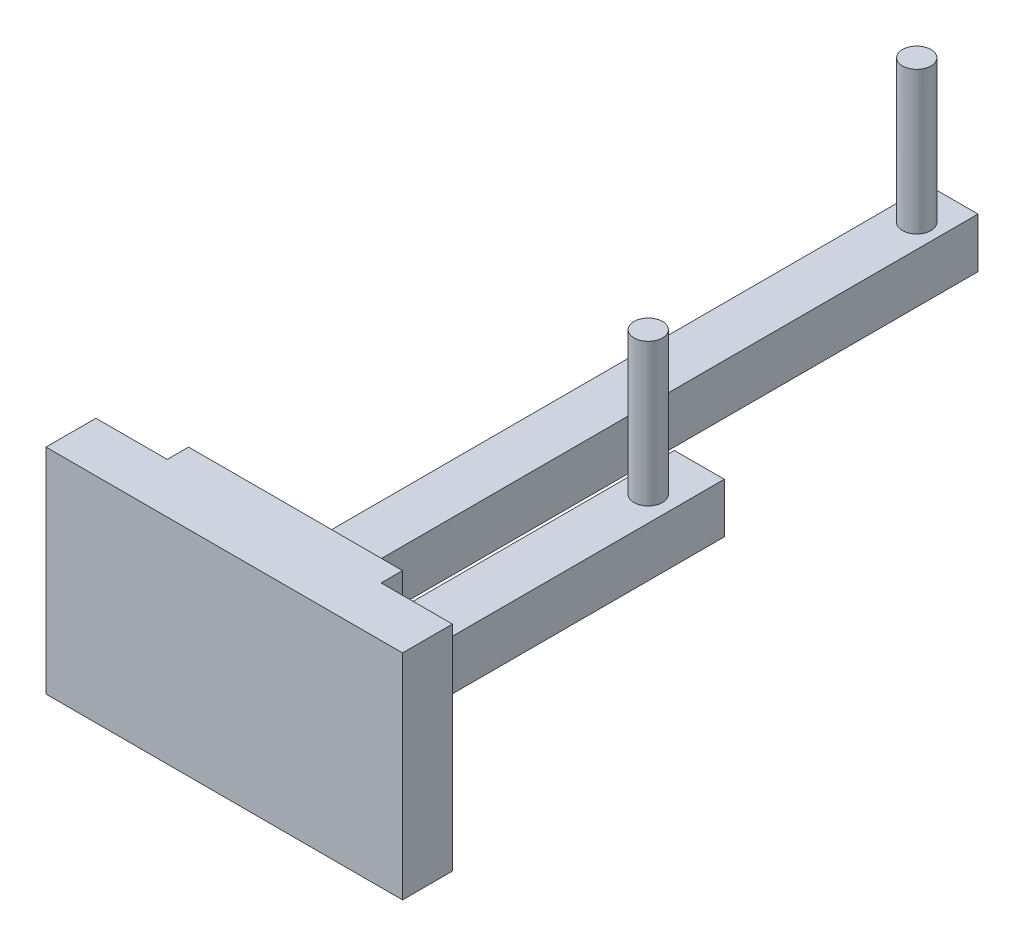
ISO-10303-21;
HEADER;
FILE_DESCRIPTION(('STEP AP214'),'2;1');
FILE_NAME('part.step','',(''),(''),'','','');
FILE_SCHEMA(('AUTOMOTIVE_DESIGN { 1 0 10303 214 1 1 1 1 }'));
ENDSEC;
DATA;
#1=APPLICATION_CONTEXT('core data for automotive mechanical design processes');
#2=APPLICATION_PROTOCOL_DEFINITION('international standard','automotive_design',2000,#1);
#3=PRODUCT_CONTEXT('',#1,'mechanical');
#4=PRODUCT('Part','Part','',(#3));
#5=PRODUCT_RELATED_PRODUCT_CATEGORY('part','',(#4));
#6=PRODUCT_DEFINITION_FORMATION('','',#4);
#7=PRODUCT_DEFINITION_CONTEXT('part definition',#1,'design');
#8=PRODUCT_DEFINITION('design','',#6,#7);
#9=PRODUCT_DEFINITION_SHAPE('','',#8);
#10=(LENGTH_UNIT() NAMED_UNIT(*) SI_UNIT(.MILLI.,.METRE.));
#11=(NAMED_UNIT(*) PLANE_ANGLE_UNIT() SI_UNIT($,.RADIAN.));
#12=(NAMED_UNIT(*) SI_UNIT($,.STERADIAN.) SOLID_ANGLE_UNIT());
#13=UNCERTAINTY_MEASURE_WITH_UNIT(LENGTH_MEASURE(1.E-05),#10,'distance_accuracy_value','');
#14=(GEOMETRIC_REPRESENTATION_CONTEXT(3) GLOBAL_UNCERTAINTY_ASSIGNED_CONTEXT((#13)) GLOBAL_UNIT_ASSIGNED_CONTEXT((#10,
#11,#12)) REPRESENTATION_CONTEXT('',''));
#15=CARTESIAN_POINT('',(0.,0.,0.));
#16=DIRECTION('',(0.,0.,1.));
#17=DIRECTION('',(1.,0.,0.));
#18=AXIS2_PLACEMENT_3D('',#15,#16,#17);
#19=CARTESIAN_POINT('',(0.,0.,-3.));
#20=DIRECTION('',(0.,0.,-1.));
#21=DIRECTION('',(-1.,0.,0.));
#22=AXIS2_PLACEMENT_3D('',#19,#20,#21);
#23=PLANE('',#22);
#24=DIRECTION('',(0.,-1.,0.));
#25=VECTOR('',#24,1.);
#26=CARTESIAN_POINT('',(15.,-15.,-3.));
#27=LINE('',#26,#25);
#28=CARTESIAN_POINT('',(15.,15.,-3.));
#29=VERTEX_POINT('',#28);
#30=CARTESIAN_POINT('',(15.,-15.,-3.));
#31=VERTEX_POINT('',#30);
#32=EDGE_CURVE('E231',#29,#31,#27,.T.);
#33=ORIENTED_EDGE('',*,*,#32,.T.);
#34=DIRECTION('',(-1.,0.,0.));
#35=VECTOR('',#34,1.);
#36=CARTESIAN_POINT('',(-15.,-15.,-3.));
#37=LINE('',#36,#35);
#38=CARTESIAN_POINT('',(-15.,-15.,-3.));
#39=VERTEX_POINT('',#38);
#40=EDGE_CURVE('E235',#31,#39,#37,.T.);
#41=ORIENTED_EDGE('',*,*,#40,.T.);
#42=DIRECTION('',(0.,1.,0.));
#43=VECTOR('',#42,1.);
#44=CARTESIAN_POINT('',(-15.,-15.,-3.));
#45=LINE('',#44,#43);
#46=CARTESIAN_POINT('',(-15.,15.,-3.));
#47=VERTEX_POINT('',#46);
#48=EDGE_CURVE('E239',#39,#47,#45,.T.);
#49=ORIENTED_EDGE('',*,*,#48,.T.);
#50=DIRECTION('',(1.,0.,0.));
#51=VECTOR('',#50,1.);
#52=CARTESIAN_POINT('',(-15.,15.,-3.));
#53=LINE('',#52,#51);
#54=EDGE_CURVE('E242',#47,#29,#53,.T.);
#55=ORIENTED_EDGE('',*,*,#54,.T.);
#56=EDGE_LOOP('',(#33,#41,#49,#55));
#57=FACE_BOUND('',#56,.T.);
#58=DIRECTION('',(-1.,0.,0.));
#59=VECTOR('',#58,1.);
#60=CARTESIAN_POINT('',(3.12091937544568,-8.34885414843089,-3.));
#61=LINE('',#60,#59);
#62=CARTESIAN_POINT('',(10.1209193754457,-8.3488541484309,-3.));
#63=VERTEX_POINT('',#62);
#64=CARTESIAN_POINT('',(3.12091937544568,-8.34885414843089,-3.));
#65=VERTEX_POINT('',#64);
#66=EDGE_CURVE('E210',#63,#65,#61,.T.);
#67=ORIENTED_EDGE('',*,*,#66,.F.);
#68=DIRECTION('',(0.,-1.,0.));
#69=VECTOR('',#68,1.);
#70=CARTESIAN_POINT('',(10.1209193754457,-8.3488541484309,-3.));
#71=LINE('',#70,#69);
#72=CARTESIAN_POINT('',(10.1209193754457,-1.3488541484309,-3.));
#73=VERTEX_POINT('',#72);
#74=EDGE_CURVE('E187',#73,#63,#71,.T.);
#75=ORIENTED_EDGE('',*,*,#74,.F.);
#76=DIRECTION('',(1.,0.,0.));
#77=VECTOR('',#76,1.);
#78=CARTESIAN_POINT('',(3.12091937544568,-1.34885414843089,-3.));
#79=LINE('',#78,#77);
#80=CARTESIAN_POINT('',(3.12091937544568,-1.34885414843089,-3.));
#81=VERTEX_POINT('',#80);
#82=EDGE_CURVE('E197',#81,#73,#79,.T.);
#83=ORIENTED_EDGE('',*,*,#82,.F.);
#84=DIRECTION('',(0.,1.,0.));
#85=VECTOR('',#84,1.);
#86=CARTESIAN_POINT('',(3.12091937544568,-8.34885414843089,-3.));
#87=LINE('',#86,#85);
#88=EDGE_CURVE('E213',#65,#81,#87,.T.);
#89=ORIENTED_EDGE('',*,*,#88,.F.);
#90=EDGE_LOOP('',(#67,#75,#83,#89));
#91=FACE_BOUND('',#90,.T.);
#92=DIRECTION('',(1.,0.,0.));
#93=VECTOR('',#92,1.);
#94=CARTESIAN_POINT('',(-4.29629000325599,-1.34885414843089,-3.));
#95=LINE('',#94,#93);
#96=CARTESIAN_POINT('',(-11.296290003256,-1.34885414843089,-3.));
#97=VERTEX_POINT('',#96);
#98=CARTESIAN_POINT('',(-4.29629000325599,-1.34885414843089,-3.));
#99=VERTEX_POINT('',#98);
#100=EDGE_CURVE('E562',#97,#99,#95,.T.);
#101=ORIENTED_EDGE('',*,*,#100,.F.);
#102=DIRECTION('',(0.,1.,0.));
#103=VECTOR('',#102,1.);
#104=CARTESIAN_POINT('',(-11.296290003256,-8.34885414843089,-3.));
#105=LINE('',#104,#103);
#106=CARTESIAN_POINT('',(-11.296290003256,-8.34885414843089,-3.));
#107=VERTEX_POINT('',#106);
#108=EDGE_CURVE('E179',#107,#97,#105,.T.);
#109=ORIENTED_EDGE('',*,*,#108,.F.);
#110=DIRECTION('',(-1.,0.,0.));
#111=VECTOR('',#110,1.);
#112=CARTESIAN_POINT('',(-4.29629000325599,-8.34885414843089,-3.));
#113=LINE('',#112,#111);
#114=CARTESIAN_POINT('',(-4.29629000325599,-8.34885414843089,-3.));
#115=VERTEX_POINT('',#114);
#116=EDGE_CURVE('E175',#115,#107,#113,.T.);
#117=ORIENTED_EDGE('',*,*,#116,.F.);
#118=DIRECTION('',(0.,-1.,0.));
#119=VECTOR('',#118,1.);
#120=CARTESIAN_POINT('',(-4.29629000325599,-8.34885414843089,-3.));
#121=LINE('',#120,#119);
#122=EDGE_CURVE('E572',#99,#115,#121,.T.);
#123=ORIENTED_EDGE('',*,*,#122,.F.);
#124=EDGE_LOOP('',(#101,#109,#117,#123));
#125=FACE_BOUND('',#124,.T.);
#126=ADVANCED_FACE('F39',(#57,#91,#125),#23,.T.);
#127=CARTESIAN_POINT('',(0.,0.,0.));
#128=DIRECTION('',(0.,0.,1.));
#129=DIRECTION('',(1.,0.,0.));
#130=AXIS2_PLACEMENT_3D('',#127,#128,#129);
#131=PLANE('',#130);
#132=DIRECTION('',(0.,-1.,0.));
#133=VECTOR('',#132,1.);
#134=CARTESIAN_POINT('',(15.,-15.,0.));
#135=LINE('',#134,#133);
#136=CARTESIAN_POINT('',(15.,15.,0.));
#137=VERTEX_POINT('',#136);
#138=CARTESIAN_POINT('',(15.,-15.,0.));
#139=VERTEX_POINT('',#138);
#140=EDGE_CURVE('E230',#137,#139,#135,.T.);
#141=ORIENTED_EDGE('',*,*,#140,.F.);
#142=DIRECTION('',(1.,0.,0.));
#143=VECTOR('',#142,1.);
#144=CARTESIAN_POINT('',(0.,15.,0.));
#145=LINE('',#144,#143);
#146=CARTESIAN_POINT('',(25.,15.,0.));
#147=VERTEX_POINT('',#146);
#148=EDGE_CURVE('E267',#137,#147,#145,.T.);
#149=ORIENTED_EDGE('',*,*,#148,.T.);
#150=DIRECTION('',(0.,1.,0.));
#151=VECTOR('',#150,1.);
#152=CARTESIAN_POINT('',(25.,0.,0.));
#153=LINE('',#152,#151);
#154=CARTESIAN_POINT('',(25.,-15.,0.));
#155=VERTEX_POINT('',#154);
#156=EDGE_CURVE('E273',#155,#147,#153,.T.);
#157=ORIENTED_EDGE('',*,*,#156,.F.);
#158=DIRECTION('',(1.,0.,0.));
#159=VECTOR('',#158,1.);
#160=CARTESIAN_POINT('',(0.,-15.,0.));
#161=LINE('',#160,#159);
#162=EDGE_CURVE('E291',#139,#155,#161,.T.);
#163=ORIENTED_EDGE('',*,*,#162,.F.);
#164=EDGE_LOOP('',(#141,#149,#157,#163));
#165=FACE_BOUND('',#164,.T.);
#166=ADVANCED_FACE('F348',(#165),#131,.F.);
#167=DIRECTION('',(0.,1.,0.));
#168=VECTOR('',#167,1.);
#169=CARTESIAN_POINT('',(-15.,-15.,0.));
#170=LINE('',#169,#168);
#171=CARTESIAN_POINT('',(-15.,-15.,0.));
#172=VERTEX_POINT('',#171);
#173=CARTESIAN_POINT('',(-15.,15.,0.));
#174=VERTEX_POINT('',#173);
#175=EDGE_CURVE('E236',#172,#174,#170,.T.);
#176=ORIENTED_EDGE('',*,*,#175,.F.);
#177=CARTESIAN_POINT('',(-25.,-15.,0.));
#178=VERTEX_POINT('',#177);
#179=EDGE_CURVE('E292',#178,#172,#161,.T.);
#180=ORIENTED_EDGE('',*,*,#179,.F.);
#181=DIRECTION('',(0.,1.,0.));
#182=VECTOR('',#181,1.);
#183=CARTESIAN_POINT('',(-25.,0.,0.));
#184=LINE('',#183,#182);
#185=CARTESIAN_POINT('',(-25.,15.,0.));
#186=VERTEX_POINT('',#185);
#187=EDGE_CURVE('E287',#178,#186,#184,.T.);
#188=ORIENTED_EDGE('',*,*,#187,.T.);
#189=EDGE_CURVE('E284',#186,#174,#145,.T.);
#190=ORIENTED_EDGE('',*,*,#189,.T.);
#191=EDGE_LOOP('',(#176,#180,#188,#190));
#192=FACE_BOUND('',#191,.T.);
#193=ADVANCED_FACE('F354',(#192),#131,.F.);
#194=CARTESIAN_POINT('',(0.,15.,7.));
#195=DIRECTION('',(0.,1.,0.));
#196=DIRECTION('',(0.,0.,1.));
#197=AXIS2_PLACEMENT_3D('',#194,#195,#196);
#198=PLANE('',#197);
#199=ORIENTED_EDGE('',*,*,#189,.F.);
#200=DIRECTION('',(0.,0.,-1.));
#201=VECTOR('',#200,1.);
#202=CARTESIAN_POINT('',(-25.,15.,7.));
#203=LINE('',#202,#201);
#204=CARTESIAN_POINT('',(-25.,15.,7.));
#205=VERTEX_POINT('',#204);
#206=EDGE_CURVE('E309',#205,#186,#203,.T.);
#207=ORIENTED_EDGE('',*,*,#206,.F.);
#208=DIRECTION('',(1.,0.,0.));
#209=VECTOR('',#208,1.);
#210=CARTESIAN_POINT('',(0.,15.,7.));
#211=LINE('',#210,#209);
#212=CARTESIAN_POINT('',(25.,15.,7.));
#213=VERTEX_POINT('',#212);
#214=EDGE_CURVE('E268',#205,#213,#211,.T.);
#215=ORIENTED_EDGE('',*,*,#214,.T.);
#216=DIRECTION('',(0.,0.,-1.));
#217=VECTOR('',#216,1.);
#218=CARTESIAN_POINT('',(25.,15.,7.));
#219=LINE('',#218,#217);
#220=EDGE_CURVE('E283',#213,#147,#219,.T.);
#221=ORIENTED_EDGE('',*,*,#220,.T.);
#222=ORIENTED_EDGE('',*,*,#148,.F.);
#223=DIRECTION('',(0.,0.,1.));
#224=VECTOR('',#223,1.);
#225=CARTESIAN_POINT('',(15.,15.,-3.));
#226=LINE('',#225,#224);
#227=EDGE_CURVE('E245',#29,#137,#226,.T.);
#228=ORIENTED_EDGE('',*,*,#227,.F.);
#229=ORIENTED_EDGE('',*,*,#54,.F.);
#230=DIRECTION('',(0.,0.,1.));
#231=VECTOR('',#230,1.);
#232=CARTESIAN_POINT('',(-15.,15.,-3.));
#233=LINE('',#232,#231);
#234=EDGE_CURVE('E255',#47,#174,#233,.T.);
#235=ORIENTED_EDGE('',*,*,#234,.T.);
#236=EDGE_LOOP('',(#199,#207,#215,#221,#222,#228,#229,#235));
#237=FACE_BOUND('',#236,.T.);
#238=ADVANCED_FACE('F41',(#237),#198,.T.);
#239=CARTESIAN_POINT('',(-25.,0.,7.));
#240=DIRECTION('',(-1.,0.,0.));
#241=DIRECTION('',(0.,0.,1.));
#242=AXIS2_PLACEMENT_3D('',#239,#240,#241);
#243=PLANE('',#242);
#244=ORIENTED_EDGE('',*,*,#187,.F.);
#245=DIRECTION('',(0.,0.,-1.));
#246=VECTOR('',#245,1.);
#247=CARTESIAN_POINT('',(-25.,-15.,7.));
#248=LINE('',#247,#246);
#249=CARTESIAN_POINT('',(-25.,-15.,7.));
#250=VERTEX_POINT('',#249);
#251=EDGE_CURVE('E306',#250,#178,#248,.T.);
#252=ORIENTED_EDGE('',*,*,#251,.F.);
#253=DIRECTION('',(0.,1.,0.));
#254=VECTOR('',#253,1.);
#255=CARTESIAN_POINT('',(-25.,0.,7.));
#256=LINE('',#255,#254);
#257=EDGE_CURVE('E272',#250,#205,#256,.T.);
#258=ORIENTED_EDGE('',*,*,#257,.T.);
#259=ORIENTED_EDGE('',*,*,#206,.T.);
#260=EDGE_LOOP('',(#244,#252,#258,#259));
#261=FACE_BOUND('',#260,.T.);
#262=ADVANCED_FACE('F378',(#261),#243,.T.);
#263=CARTESIAN_POINT('',(0.,-15.,7.));
#264=DIRECTION('',(0.,1.,0.));
#265=DIRECTION('',(0.,0.,1.));
#266=AXIS2_PLACEMENT_3D('',#263,#264,#265);
#267=PLANE('',#266);
#268=ORIENTED_EDGE('',*,*,#179,.T.);
#269=DIRECTION('',(0.,0.,1.));
#270=VECTOR('',#269,1.);
#271=CARTESIAN_POINT('',(-15.,-15.,-3.));
#272=LINE('',#271,#270);
#273=EDGE_CURVE('E259',#39,#172,#272,.T.);
#274=ORIENTED_EDGE('',*,*,#273,.F.);
#275=ORIENTED_EDGE('',*,*,#40,.F.);
#276=DIRECTION('',(0.,0.,1.));
#277=VECTOR('',#276,1.);
#278=CARTESIAN_POINT('',(15.,-15.,-3.));
#279=LINE('',#278,#277);
#280=EDGE_CURVE('E263',#31,#139,#279,.T.);
#281=ORIENTED_EDGE('',*,*,#280,.T.);
#282=ORIENTED_EDGE('',*,*,#162,.T.);
#283=DIRECTION('',(0.,0.,-1.));
#284=VECTOR('',#283,1.);
#285=CARTESIAN_POINT('',(25.,-15.,7.));
#286=LINE('',#285,#284);
#287=CARTESIAN_POINT('',(25.,-15.,7.));
#288=VERTEX_POINT('',#287);
#289=EDGE_CURVE('E302',#288,#155,#286,.T.);
#290=ORIENTED_EDGE('',*,*,#289,.F.);
#291=DIRECTION('',(1.,0.,0.));
#292=VECTOR('',#291,1.);
#293=CARTESIAN_POINT('',(0.,-15.,7.));
#294=LINE('',#293,#292);
#295=EDGE_CURVE('E277',#250,#288,#294,.T.);
#296=ORIENTED_EDGE('',*,*,#295,.F.);
#297=ORIENTED_EDGE('',*,*,#251,.T.);
#298=EDGE_LOOP('',(#268,#274,#275,#281,#282,#290,#296,#297));
#299=FACE_BOUND('',#298,.T.);
#300=ADVANCED_FACE('F375',(#299),#267,.F.);
#301=CARTESIAN_POINT('',(25.,0.,7.));
#302=DIRECTION('',(-1.,0.,0.));
#303=DIRECTION('',(0.,0.,1.));
#304=AXIS2_PLACEMENT_3D('',#301,#302,#303);
#305=PLANE('',#304);
#306=ORIENTED_EDGE('',*,*,#156,.T.);
#307=ORIENTED_EDGE('',*,*,#220,.F.);
#308=DIRECTION('',(0.,1.,0.));
#309=VECTOR('',#308,1.);
#310=CARTESIAN_POINT('',(25.,0.,7.));
#311=LINE('',#310,#309);
#312=EDGE_CURVE('E280',#288,#213,#311,.T.);
#313=ORIENTED_EDGE('',*,*,#312,.F.);
#314=ORIENTED_EDGE('',*,*,#289,.T.);
#315=EDGE_LOOP('',(#306,#307,#313,#314));
#316=FACE_BOUND('',#315,.T.);
#317=ADVANCED_FACE('F370',(#316),#305,.F.);
#318=CARTESIAN_POINT('',(0.,0.,7.));
#319=DIRECTION('',(0.,0.,1.));
#320=DIRECTION('',(1.,0.,0.));
#321=AXIS2_PLACEMENT_3D('',#318,#319,#320);
#322=PLANE('',#321);
#323=ORIENTED_EDGE('',*,*,#214,.F.);
#324=ORIENTED_EDGE('',*,*,#257,.F.);
#325=ORIENTED_EDGE('',*,*,#295,.T.);
#326=ORIENTED_EDGE('',*,*,#312,.T.);
#327=EDGE_LOOP('',(#323,#324,#325,#326));
#328=FACE_BOUND('',#327,.T.);
#329=ADVANCED_FACE('F367',(#328),#322,.T.);
#330=CARTESIAN_POINT('',(15.,-15.,-3.));
#331=DIRECTION('',(-1.,0.,0.));
#332=DIRECTION('',(0.,0.,1.));
#333=AXIS2_PLACEMENT_3D('',#330,#331,#332);
#334=PLANE('',#333);
#335=ORIENTED_EDGE('',*,*,#140,.T.);
#336=ORIENTED_EDGE('',*,*,#280,.F.);
#337=ORIENTED_EDGE('',*,*,#32,.F.);
#338=ORIENTED_EDGE('',*,*,#227,.T.);
#339=EDGE_LOOP('',(#335,#336,#337,#338));
#340=FACE_BOUND('',#339,.T.);
#341=ADVANCED_FACE('F363',(#340),#334,.F.);
#342=CARTESIAN_POINT('',(-15.,-15.,-3.));
#343=DIRECTION('',(1.,0.,0.));
#344=DIRECTION('',(0.,0.,-1.));
#345=AXIS2_PLACEMENT_3D('',#342,#343,#344);
#346=PLANE('',#345);
#347=ORIENTED_EDGE('',*,*,#175,.T.);
#348=ORIENTED_EDGE('',*,*,#234,.F.);
#349=ORIENTED_EDGE('',*,*,#48,.F.);
#350=ORIENTED_EDGE('',*,*,#273,.T.);
#351=EDGE_LOOP('',(#347,#348,#349,#350));
#352=FACE_BOUND('',#351,.T.);
#353=ADVANCED_FACE('F360',(#352),#346,.F.);
#354=CARTESIAN_POINT('',(10.1209193754457,-8.3488541484309,-53.));
#355=DIRECTION('',(-1.,0.,0.));
#356=DIRECTION('',(0.,0.,1.));
#357=AXIS2_PLACEMENT_3D('',#354,#355,#356);
#358=PLANE('',#357);
#359=ORIENTED_EDGE('',*,*,#74,.T.);
#360=DIRECTION('',(0.,0.,1.));
#361=VECTOR('',#360,1.);
#362=CARTESIAN_POINT('',(10.1209193754457,-8.3488541484309,-53.));
#363=LINE('',#362,#361);
#364=CARTESIAN_POINT('',(10.1209193754457,-8.3488541484309,-53.));
#365=VERTEX_POINT('',#364);
#366=EDGE_CURVE('E227',#365,#63,#363,.T.);
#367=ORIENTED_EDGE('',*,*,#366,.F.);
#368=DIRECTION('',(0.,-1.,0.));
#369=VECTOR('',#368,1.);
#370=CARTESIAN_POINT('',(10.1209193754457,-8.3488541484309,-53.));
#371=LINE('',#370,#369);
#372=CARTESIAN_POINT('',(10.1209193754457,-1.3488541484309,-53.));
#373=VERTEX_POINT('',#372);
#374=EDGE_CURVE('E192',#373,#365,#371,.T.);
#375=ORIENTED_EDGE('',*,*,#374,.F.);
#376=DIRECTION('',(0.,0.,1.));
#377=VECTOR('',#376,1.);
#378=CARTESIAN_POINT('',(10.1209193754457,-1.3488541484309,-53.));
#379=LINE('',#378,#377);
#380=EDGE_CURVE('E206',#373,#73,#379,.T.);
#381=ORIENTED_EDGE('',*,*,#380,.T.);
#382=EDGE_LOOP('',(#359,#367,#375,#381));
#383=FACE_BOUND('',#382,.T.);
#384=ADVANCED_FACE('F329',(#383),#358,.F.);
#385=CARTESIAN_POINT('',(3.12091937544568,-8.34885414843089,-53.));
#386=DIRECTION('',(0.,1.,0.));
#387=DIRECTION('',(-1.,0.,0.));
#388=AXIS2_PLACEMENT_3D('',#385,#386,#387);
#389=PLANE('',#388);
#390=ORIENTED_EDGE('',*,*,#66,.T.);
#391=DIRECTION('',(0.,0.,1.));
#392=VECTOR('',#391,1.);
#393=CARTESIAN_POINT('',(3.12091937544568,-8.34885414843089,-53.));
#394=LINE('',#393,#392);
#395=CARTESIAN_POINT('',(3.12091937544568,-8.34885414843089,-53.));
#396=VERTEX_POINT('',#395);
#397=EDGE_CURVE('E223',#396,#65,#394,.T.);
#398=ORIENTED_EDGE('',*,*,#397,.F.);
#399=DIRECTION('',(-1.,0.,0.));
#400=VECTOR('',#399,1.);
#401=CARTESIAN_POINT('',(3.12091937544568,-8.34885414843089,-53.));
#402=LINE('',#401,#400);
#403=EDGE_CURVE('E196',#365,#396,#402,.T.);
#404=ORIENTED_EDGE('',*,*,#403,.F.);
#405=ORIENTED_EDGE('',*,*,#366,.T.);
#406=EDGE_LOOP('',(#390,#398,#404,#405));
#407=FACE_BOUND('',#406,.T.);
#408=ADVANCED_FACE('F335',(#407),#389,.F.);
#409=CARTESIAN_POINT('',(3.12091937544568,-8.34885414843089,-53.));
#410=DIRECTION('',(1.,0.,0.));
#411=DIRECTION('',(0.,0.,-1.));
#412=AXIS2_PLACEMENT_3D('',#409,#410,#411);
#413=PLANE('',#412);
#414=ORIENTED_EDGE('',*,*,#88,.T.);
#415=DIRECTION('',(0.,0.,1.));
#416=VECTOR('',#415,1.);
#417=CARTESIAN_POINT('',(3.12091937544568,-1.34885414843089,-53.));
#418=LINE('',#417,#416);
#419=CARTESIAN_POINT('',(3.12091937544568,-1.34885414843089,-53.));
#420=VERTEX_POINT('',#419);
#421=EDGE_CURVE('E63',#420,#81,#418,.T.);
#422=ORIENTED_EDGE('',*,*,#421,.F.);
#423=DIRECTION('',(0.,1.,0.));
#424=VECTOR('',#423,1.);
#425=CARTESIAN_POINT('',(3.12091937544568,-8.34885414843089,-53.));
#426=LINE('',#425,#424);
#427=EDGE_CURVE('E200',#396,#420,#426,.T.);
#428=ORIENTED_EDGE('',*,*,#427,.F.);
#429=ORIENTED_EDGE('',*,*,#397,.T.);
#430=EDGE_LOOP('',(#414,#422,#428,#429));
#431=FACE_BOUND('',#430,.T.);
#432=ADVANCED_FACE('F320',(#431),#413,.F.);
#433=CARTESIAN_POINT('',(3.12091937544568,-1.34885414843089,-53.));
#434=DIRECTION('',(0.,-1.,0.));
#435=DIRECTION('',(1.,0.,0.));
#436=AXIS2_PLACEMENT_3D('',#433,#434,#435);
#437=PLANE('',#436);
#438=CARTESIAN_POINT('',(6.62091937544568,-1.34885414843089,-45.8377635902778));
#439=DIRECTION('',(0.,-1.,0.));
#440=DIRECTION('',(1.,0.,0.));
#441=AXIS2_PLACEMENT_3D('',#438,#439,#440);
#442=CIRCLE('',#441,2.);
#443=CARTESIAN_POINT('',(8.62091937544568,-1.34885414843089,-45.8377635902778));
#444=VERTEX_POINT('',#443);
#445=EDGE_CURVE('E48',#444,#444,#442,.F.);
#446=ORIENTED_EDGE('',*,*,#445,.F.);
#447=EDGE_LOOP('',(#446));
#448=FACE_BOUND('',#447,.T.);
#449=ORIENTED_EDGE('',*,*,#82,.T.);
#450=ORIENTED_EDGE('',*,*,#380,.F.);
#451=DIRECTION('',(1.,0.,0.));
#452=VECTOR('',#451,1.);
#453=CARTESIAN_POINT('',(3.12091937544568,-1.34885414843089,-53.));
#454=LINE('',#453,#452);
#455=EDGE_CURVE('E203',#420,#373,#454,.T.);
#456=ORIENTED_EDGE('',*,*,#455,.F.);
#457=ORIENTED_EDGE('',*,*,#421,.T.);
#458=EDGE_LOOP('',(#449,#450,#456,#457));
#459=FACE_BOUND('',#458,.T.);
#460=ADVANCED_FACE('F317',(#448,#459),#437,.F.);
#461=CARTESIAN_POINT('',(0.,0.,-53.));
#462=DIRECTION('',(0.,0.,-1.));
#463=DIRECTION('',(-1.,0.,0.));
#464=AXIS2_PLACEMENT_3D('',#461,#462,#463);
#465=PLANE('',#464);
#466=ORIENTED_EDGE('',*,*,#374,.T.);
#467=ORIENTED_EDGE('',*,*,#403,.T.);
#468=ORIENTED_EDGE('',*,*,#427,.T.);
#469=ORIENTED_EDGE('',*,*,#455,.T.);
#470=EDGE_LOOP('',(#466,#467,#468,#469));
#471=FACE_BOUND('',#470,.T.);
#472=ADVANCED_FACE('F319',(#471),#465,.T.);
#473=CARTESIAN_POINT('',(6.62091937544568,18.6511458515691,-45.8377635902778));
#474=DIRECTION('',(0.,-1.,0.));
#475=DIRECTION('',(1.,0.,0.));
#476=AXIS2_PLACEMENT_3D('',#473,#474,#475);
#477=CYLINDRICAL_SURFACE('',#476,2.);
#478=CARTESIAN_POINT('',(6.62091937544568,18.6511458515691,-45.8377635902778));
#479=DIRECTION('',(0.,1.,0.));
#480=DIRECTION('',(-1.,0.,0.));
#481=AXIS2_PLACEMENT_3D('',#478,#479,#480);
#482=CIRCLE('',#481,2.);
#483=CARTESIAN_POINT('',(4.62091937544568,18.6511458515691,-45.8377635902778));
#484=VERTEX_POINT('',#483);
#485=EDGE_CURVE('E182',#484,#484,#482,.T.);
#486=ORIENTED_EDGE('',*,*,#485,.F.);
#487=EDGE_LOOP('',(#486));
#488=FACE_BOUND('',#487,.T.);
#489=ORIENTED_EDGE('',*,*,#445,.T.);
#490=EDGE_LOOP('',(#489));
#491=FACE_BOUND('',#490,.T.);
#492=ADVANCED_FACE('F315',(#488,#491),#477,.T.);
#493=CARTESIAN_POINT('',(6.62091937544568,18.6511458515691,-45.8377635902778));
#494=DIRECTION('',(0.,1.,0.));
#495=DIRECTION('',(-1.,0.,0.));
#496=AXIS2_PLACEMENT_3D('',#493,#494,#495);
#497=PLANE('',#496);
#498=ORIENTED_EDGE('',*,*,#485,.T.);
#499=EDGE_LOOP('',(#498));
#500=FACE_BOUND('',#499,.T.);
#501=ADVANCED_FACE('F344',(#500),#497,.T.);
#502=CARTESIAN_POINT('',(-11.296290003256,-8.34885414843089,-103.));
#503=DIRECTION('',(1.,0.,0.));
#504=DIRECTION('',(0.,0.,-1.));
#505=AXIS2_PLACEMENT_3D('',#502,#503,#504);
#506=PLANE('',#505);
#507=ORIENTED_EDGE('',*,*,#108,.T.);
#508=DIRECTION('',(0.,0.,1.));
#509=VECTOR('',#508,1.);
#510=CARTESIAN_POINT('',(-11.296290003256,-1.34885414843089,-103.));
#511=LINE('',#510,#509);
#512=CARTESIAN_POINT('',(-11.296290003256,-1.34885414843089,-103.));
#513=VERTEX_POINT('',#512);
#514=EDGE_CURVE('E158',#513,#97,#511,.T.);
#515=ORIENTED_EDGE('',*,*,#514,.F.);
#516=DIRECTION('',(0.,1.,0.));
#517=VECTOR('',#516,1.);
#518=CARTESIAN_POINT('',(-11.296290003256,-8.34885414843089,-103.));
#519=LINE('',#518,#517);
#520=CARTESIAN_POINT('',(-11.296290003256,-8.34885414843089,-103.));
#521=VERTEX_POINT('',#520);
#522=EDGE_CURVE('E166',#521,#513,#519,.T.);
#523=ORIENTED_EDGE('',*,*,#522,.F.);
#524=DIRECTION('',(0.,0.,1.));
#525=VECTOR('',#524,1.);
#526=CARTESIAN_POINT('',(-11.296290003256,-8.34885414843089,-103.));
#527=LINE('',#526,#525);
#528=EDGE_CURVE('E568',#521,#107,#527,.T.);
#529=ORIENTED_EDGE('',*,*,#528,.T.);
#530=EDGE_LOOP('',(#507,#515,#523,#529));
#531=FACE_BOUND('',#530,.T.);
#532=ADVANCED_FACE('F177',(#531),#506,.F.);
#533=CARTESIAN_POINT('',(-4.29629000325599,-1.34885414843089,-103.));
#534=DIRECTION('',(0.,-1.,0.));
#535=DIRECTION('',(0.,0.,-1.));
#536=AXIS2_PLACEMENT_3D('',#533,#534,#535);
#537=PLANE('',#536);
#538=CARTESIAN_POINT('',(-7.58336305646523,-1.34885414843089,-97.6960427982334));
#539=DIRECTION('',(0.,-1.,0.));
#540=DIRECTION('',(0.,0.,-1.));
#541=AXIS2_PLACEMENT_3D('',#538,#539,#540);
#542=CIRCLE('',#541,2.);
#543=CARTESIAN_POINT('',(-7.58336305646523,-1.34885414843089,-99.6960427982334));
#544=VERTEX_POINT('',#543);
#545=EDGE_CURVE('E11',#544,#544,#542,.F.);
#546=ORIENTED_EDGE('',*,*,#545,.F.);
#547=EDGE_LOOP('',(#546));
#548=FACE_BOUND('',#547,.T.);
#549=ORIENTED_EDGE('',*,*,#100,.T.);
#550=DIRECTION('',(0.,0.,1.));
#551=VECTOR('',#550,1.);
#552=CARTESIAN_POINT('',(-4.29629000325599,-1.34885414843089,-103.));
#553=LINE('',#552,#551);
#554=CARTESIAN_POINT('',(-4.29629000325599,-1.34885414843089,-103.));
#555=VERTEX_POINT('',#554);
#556=EDGE_CURVE('E161',#555,#99,#553,.T.);
#557=ORIENTED_EDGE('',*,*,#556,.F.);
#558=DIRECTION('',(1.,0.,0.));
#559=VECTOR('',#558,1.);
#560=CARTESIAN_POINT('',(-4.29629000325599,-1.34885414843089,-103.));
#561=LINE('',#560,#559);
#562=EDGE_CURVE('E154',#513,#555,#561,.T.);
#563=ORIENTED_EDGE('',*,*,#562,.F.);
#564=ORIENTED_EDGE('',*,*,#514,.T.);
#565=EDGE_LOOP('',(#549,#557,#563,#564));
#566=FACE_BOUND('',#565,.T.);
#567=ADVANCED_FACE('F156',(#548,#566),#537,.F.);
#568=CARTESIAN_POINT('',(-4.29629000325599,-8.34885414843089,-103.));
#569=DIRECTION('',(-1.,0.,0.));
#570=DIRECTION('',(0.,0.,1.));
#571=AXIS2_PLACEMENT_3D('',#568,#569,#570);
#572=PLANE('',#571);
#573=ORIENTED_EDGE('',*,*,#122,.T.);
#574=DIRECTION('',(0.,0.,1.));
#575=VECTOR('',#574,1.);
#576=CARTESIAN_POINT('',(-4.29629000325599,-8.34885414843089,-103.));
#577=LINE('',#576,#575);
#578=CARTESIAN_POINT('',(-4.29629000325599,-8.34885414843089,-103.));
#579=VERTEX_POINT('',#578);
#580=EDGE_CURVE('E55',#579,#115,#577,.T.);
#581=ORIENTED_EDGE('',*,*,#580,.F.);
#582=DIRECTION('',(0.,-1.,0.));
#583=VECTOR('',#582,1.);
#584=CARTESIAN_POINT('',(-4.29629000325599,-8.34885414843089,-103.));
#585=LINE('',#584,#583);
#586=EDGE_CURVE('E165',#555,#579,#585,.T.);
#587=ORIENTED_EDGE('',*,*,#586,.F.);
#588=ORIENTED_EDGE('',*,*,#556,.T.);
#589=EDGE_LOOP('',(#573,#581,#587,#588));
#590=FACE_BOUND('',#589,.T.);
#591=ADVANCED_FACE('F503',(#590),#572,.F.);
#592=CARTESIAN_POINT('',(-4.29629000325599,-8.34885414843089,-103.));
#593=DIRECTION('',(0.,1.,0.));
#594=DIRECTION('',(0.,0.,1.));
#595=AXIS2_PLACEMENT_3D('',#592,#593,#594);
#596=PLANE('',#595);
#597=ORIENTED_EDGE('',*,*,#116,.T.);
#598=ORIENTED_EDGE('',*,*,#528,.F.);
#599=DIRECTION('',(-1.,0.,0.));
#600=VECTOR('',#599,1.);
#601=CARTESIAN_POINT('',(-4.29629000325599,-8.34885414843089,-103.));
#602=LINE('',#601,#600);
#603=EDGE_CURVE('E170',#579,#521,#602,.T.);
#604=ORIENTED_EDGE('',*,*,#603,.F.);
#605=ORIENTED_EDGE('',*,*,#580,.T.);
#606=EDGE_LOOP('',(#597,#598,#604,#605));
#607=FACE_BOUND('',#606,.T.);
#608=ADVANCED_FACE('F508',(#607),#596,.F.);
#609=CARTESIAN_POINT('',(0.,0.,-103.));
#610=DIRECTION('',(0.,0.,1.));
#611=DIRECTION('',(1.,0.,0.));
#612=AXIS2_PLACEMENT_3D('',#609,#610,#611);
#613=PLANE('',#612);
#614=ORIENTED_EDGE('',*,*,#522,.T.);
#615=ORIENTED_EDGE('',*,*,#562,.T.);
#616=ORIENTED_EDGE('',*,*,#586,.T.);
#617=ORIENTED_EDGE('',*,*,#603,.T.);
#618=EDGE_LOOP('',(#614,#615,#616,#617));
#619=FACE_BOUND('',#618,.T.);
#620=ADVANCED_FACE('F169',(#619),#613,.F.);
#621=CARTESIAN_POINT('',(-7.58336305646523,18.6511458515691,-97.6960427982334));
#622=DIRECTION('',(0.,-1.,0.));
#623=DIRECTION('',(0.,0.,-1.));
#624=AXIS2_PLACEMENT_3D('',#621,#622,#623);
#625=CYLINDRICAL_SURFACE('',#624,2.);
#626=CARTESIAN_POINT('',(-7.58336305646523,18.6511458515691,-97.6960427982334));
#627=DIRECTION('',(0.,1.,0.));
#628=DIRECTION('',(0.,0.,1.));
#629=AXIS2_PLACEMENT_3D('',#626,#627,#628);
#630=CIRCLE('',#629,2.);
#631=CARTESIAN_POINT('',(-7.58336305646523,18.6511458515691,-95.6960427982334));
#632=VERTEX_POINT('',#631);
#633=EDGE_CURVE('E558',#632,#632,#630,.T.);
#634=ORIENTED_EDGE('',*,*,#633,.F.);
#635=EDGE_LOOP('',(#634));
#636=FACE_BOUND('',#635,.T.);
#637=ORIENTED_EDGE('',*,*,#545,.T.);
#638=EDGE_LOOP('',(#637));
#639=FACE_BOUND('',#638,.T.);
#640=ADVANCED_FACE('F526',(#636,#639),#625,.T.);
#641=CARTESIAN_POINT('',(-7.58336305646523,18.6511458515691,-97.6960427982334));
#642=DIRECTION('',(0.,1.,0.));
#643=DIRECTION('',(0.,0.,1.));
#644=AXIS2_PLACEMENT_3D('',#641,#642,#643);
#645=PLANE('',#644);
#646=ORIENTED_EDGE('',*,*,#633,.T.);
#647=EDGE_LOOP('',(#646));
#648=FACE_BOUND('',#647,.T.);
#649=ADVANCED_FACE('F542',(#648),#645,.T.);
#650=CLOSED_SHELL('',(#126,#166,#193,#238,#262,#300,#317,#329,#341,#353,#384,#408,#432,#460,
#472,#492,#501,#532,#567,#591,#608,#620,#640,#649));
#651=MANIFOLD_SOLID_BREP('B2',#650);
#652=ADVANCED_BREP_SHAPE_REPRESENTATION('',(#18,#651),#14);
#653=SHAPE_DEFINITION_REPRESENTATION(#9,#652);
ENDSEC;
END-ISO-10303-21;
